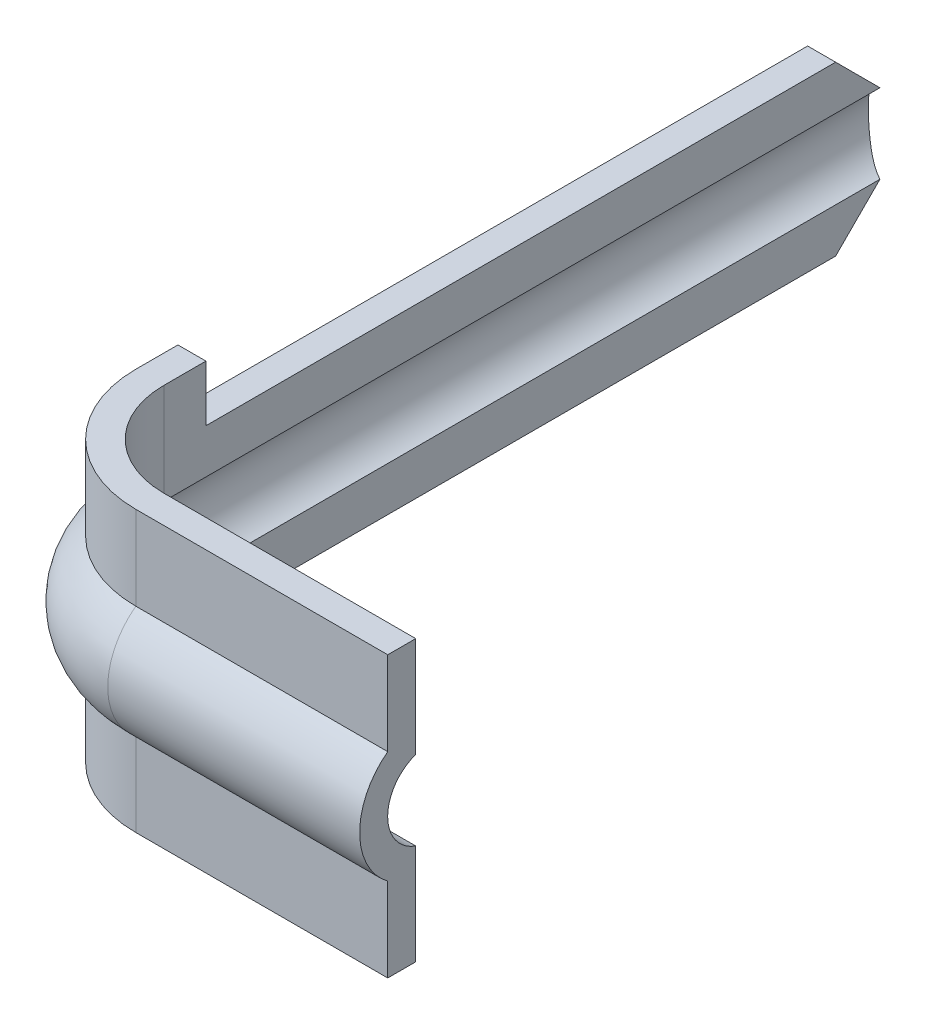
ISO-10303-21;
HEADER;
FILE_DESCRIPTION(('STEP AP214'),'2;1');
FILE_NAME('part.step','',(''),(''),'','','');
FILE_SCHEMA(('AUTOMOTIVE_DESIGN { 1 0 10303 214 1 1 1 1 }'));
ENDSEC;
DATA;
#1=APPLICATION_CONTEXT('core data for automotive mechanical design processes');
#2=APPLICATION_PROTOCOL_DEFINITION('international standard','automotive_design',2000,#1);
#3=PRODUCT_CONTEXT('',#1,'mechanical');
#4=PRODUCT('Part','Part','',(#3));
#5=PRODUCT_RELATED_PRODUCT_CATEGORY('part','',(#4));
#6=PRODUCT_DEFINITION_FORMATION('','',#4);
#7=PRODUCT_DEFINITION_CONTEXT('part definition',#1,'design');
#8=PRODUCT_DEFINITION('design','',#6,#7);
#9=PRODUCT_DEFINITION_SHAPE('','',#8);
#10=(LENGTH_UNIT() NAMED_UNIT(*) SI_UNIT(.MILLI.,.METRE.));
#11=(NAMED_UNIT(*) PLANE_ANGLE_UNIT() SI_UNIT($,.RADIAN.));
#12=(NAMED_UNIT(*) SI_UNIT($,.STERADIAN.) SOLID_ANGLE_UNIT());
#13=UNCERTAINTY_MEASURE_WITH_UNIT(LENGTH_MEASURE(1.E-05),#10,'distance_accuracy_value','');
#14=(GEOMETRIC_REPRESENTATION_CONTEXT(3) GLOBAL_UNCERTAINTY_ASSIGNED_CONTEXT((#13)) GLOBAL_UNIT_ASSIGNED_CONTEXT((#10,
#11,#12)) REPRESENTATION_CONTEXT('',''));
#15=CARTESIAN_POINT('',(0.,0.,0.));
#16=DIRECTION('',(0.,0.,1.));
#17=DIRECTION('',(1.,0.,0.));
#18=AXIS2_PLACEMENT_3D('',#15,#16,#17);
#19=CARTESIAN_POINT('',(0.65,0.,4.47548513561487));
#20=DIRECTION('',(1.,0.,0.));
#21=DIRECTION('',(0.,0.,-1.));
#22=AXIS2_PLACEMENT_3D('',#19,#20,#21);
#23=CYLINDRICAL_SURFACE('',#22,0.375);
#24=DIRECTION('',(1.,0.,0.));
#25=VECTOR('',#24,1.);
#26=CARTESIAN_POINT('',(0.65,0.300363239545214,4.7));
#27=LINE('',#26,#25);
#28=CARTESIAN_POINT('',(0.65,0.300363239545214,4.7));
#29=VERTEX_POINT('',#28);
#30=CARTESIAN_POINT('',(2.,0.300363239545216,4.7));
#31=VERTEX_POINT('',#30);
#32=EDGE_CURVE('E160',#29,#31,#27,.T.);
#33=ORIENTED_EDGE('',*,*,#32,.F.);
#34=CARTESIAN_POINT('',(0.65,0.,4.47548513561487));
#35=DIRECTION('',(1.,0.,0.));
#36=DIRECTION('',(0.,0.,-1.));
#37=AXIS2_PLACEMENT_3D('',#34,#35,#36);
#38=CIRCLE('',#37,0.375);
#39=CARTESIAN_POINT('',(0.65,-0.300363239545311,4.7));
#40=VERTEX_POINT('',#39);
#41=EDGE_CURVE('E164',#29,#40,#38,.T.);
#42=ORIENTED_EDGE('',*,*,#41,.T.);
#43=DIRECTION('',(1.,0.,0.));
#44=VECTOR('',#43,1.);
#45=CARTESIAN_POINT('',(0.65,-0.300363239545311,4.7));
#46=LINE('',#45,#44);
#47=CARTESIAN_POINT('',(2.,-0.300363239545313,4.7));
#48=VERTEX_POINT('',#47);
#49=EDGE_CURVE('E162',#48,#40,#46,.F.);
#50=ORIENTED_EDGE('',*,*,#49,.F.);
#51=CARTESIAN_POINT('',(2.,0.,4.47548513561487));
#52=DIRECTION('',(1.,0.,0.));
#53=DIRECTION('',(0.,0.,-1.));
#54=AXIS2_PLACEMENT_3D('',#51,#52,#53);
#55=CIRCLE('',#54,0.375);
#56=EDGE_CURVE('E19',#48,#31,#55,.F.);
#57=ORIENTED_EDGE('',*,*,#56,.T.);
#58=EDGE_LOOP('',(#33,#42,#50,#57));
#59=FACE_BOUND('',#58,.T.);
#60=ADVANCED_FACE('F16',(#59),#23,.T.);
#61=CARTESIAN_POINT('',(0.65,0.,4.47548513561487));
#62=DIRECTION('',(1.,0.,0.));
#63=DIRECTION('',(0.,0.,-1.));
#64=AXIS2_PLACEMENT_3D('',#61,#62,#63);
#65=CYLINDRICAL_SURFACE('',#64,0.225);
#66=CARTESIAN_POINT('',(2.,0.,4.47548513561487));
#67=DIRECTION('',(1.,0.,0.));
#68=DIRECTION('',(0.,0.,-1.));
#69=AXIS2_PLACEMENT_3D('',#66,#67,#68);
#70=CIRCLE('',#69,0.225);
#71=CARTESIAN_POINT('',(2.,0.212302932117396,4.55));
#72=VERTEX_POINT('',#71);
#73=CARTESIAN_POINT('',(2.,-0.212302933509844,4.54999999603301));
#74=VERTEX_POINT('',#73);
#75=EDGE_CURVE('E178',#72,#74,#70,.T.);
#76=ORIENTED_EDGE('',*,*,#75,.T.);
#77=DIRECTION('',(-1.,0.,0.));
#78=VECTOR('',#77,1.);
#79=CARTESIAN_POINT('',(0.65,-0.212302933509843,4.54999999603301));
#80=LINE('',#79,#78);
#81=CARTESIAN_POINT('',(0.65,-0.212302933509843,4.54999999603301));
#82=VERTEX_POINT('',#81);
#83=EDGE_CURVE('E244',#82,#74,#80,.F.);
#84=ORIENTED_EDGE('',*,*,#83,.F.);
#85=CARTESIAN_POINT('',(0.65,0.,4.47548513561486));
#86=DIRECTION('',(1.,0.,0.));
#87=DIRECTION('',(0.,0.,1.));
#88=AXIS2_PLACEMENT_3D('',#85,#86,#87);
#89=CIRCLE('',#88,0.225);
#90=CARTESIAN_POINT('',(0.65,0.212302932117393,4.55000000000001));
#91=VERTEX_POINT('',#90);
#92=EDGE_CURVE('E269',#82,#91,#89,.F.);
#93=ORIENTED_EDGE('',*,*,#92,.T.);
#94=DIRECTION('',(-1.,0.,0.));
#95=VECTOR('',#94,1.);
#96=CARTESIAN_POINT('',(0.65,0.212302932117392,4.55));
#97=LINE('',#96,#95);
#98=EDGE_CURVE('E217',#72,#91,#97,.T.);
#99=ORIENTED_EDGE('',*,*,#98,.F.);
#100=EDGE_LOOP('',(#76,#84,#93,#99));
#101=FACE_BOUND('',#100,.T.);
#102=ADVANCED_FACE('F289',(#101),#65,.F.);
#103=CARTESIAN_POINT('',(0.65,0.,4.05));
#104=DIRECTION('',(0.,1.,0.));
#105=DIRECTION('',(0.,0.,1.));
#106=AXIS2_PLACEMENT_3D('',#103,#104,#105);
#107=TOROIDAL_SURFACE('',#106,0.425485135614863,0.225);
#108=ORIENTED_EDGE('',*,*,#92,.F.);
#109=CARTESIAN_POINT('',(0.65,-0.212302933509843,4.05));
#110=DIRECTION('',(0.,1.,0.));
#111=DIRECTION('',(0.,0.,1.));
#112=AXIS2_PLACEMENT_3D('',#109,#110,#111);
#113=CIRCLE('',#112,0.49999999603301);
#114=CARTESIAN_POINT('',(0.15000000396699,-0.212302933509843,4.05));
#115=VERTEX_POINT('',#114);
#116=EDGE_CURVE('E245',#82,#115,#113,.F.);
#117=ORIENTED_EDGE('',*,*,#116,.T.);
#118=CARTESIAN_POINT('',(0.224514864385137,0.,4.05));
#119=DIRECTION('',(0.,0.,1.));
#120=DIRECTION('',(1.,0.,0.));
#121=AXIS2_PLACEMENT_3D('',#118,#119,#120);
#122=CIRCLE('',#121,0.225);
#123=CARTESIAN_POINT('',(0.149999999999983,0.212302932117392,4.05));
#124=VERTEX_POINT('',#123);
#125=EDGE_CURVE('E227',#115,#124,#122,.F.);
#126=ORIENTED_EDGE('',*,*,#125,.T.);
#127=CARTESIAN_POINT('',(0.65,0.212302932117392,4.05));
#128=DIRECTION('',(0.,1.,0.));
#129=DIRECTION('',(0.,0.,1.));
#130=AXIS2_PLACEMENT_3D('',#127,#128,#129);
#131=CIRCLE('',#130,0.500000000000017);
#132=EDGE_CURVE('E213',#124,#91,#131,.T.);
#133=ORIENTED_EDGE('',*,*,#132,.T.);
#134=EDGE_LOOP('',(#108,#117,#126,#133));
#135=FACE_BOUND('',#134,.T.);
#136=ADVANCED_FACE('F285',(#135),#107,.F.);
#137=CARTESIAN_POINT('',(0.65,0.,4.05));
#138=DIRECTION('',(0.,1.,0.));
#139=DIRECTION('',(0.,0.,1.));
#140=AXIS2_PLACEMENT_3D('',#137,#138,#139);
#141=CYLINDRICAL_SURFACE('',#140,0.49999999603301);
#142=CARTESIAN_POINT('',(0.65,-0.75,4.05));
#143=DIRECTION('',(0.,1.,0.));
#144=DIRECTION('',(0.,0.,1.));
#145=AXIS2_PLACEMENT_3D('',#142,#143,#144);
#146=CIRCLE('',#145,0.49999999603301);
#147=CARTESIAN_POINT('',(0.150000003852884,-0.75,4.05));
#148=VERTEX_POINT('',#147);
#149=CARTESIAN_POINT('',(0.65,-0.75,4.54999999603301));
#150=VERTEX_POINT('',#149);
#151=EDGE_CURVE('E368',#148,#150,#146,.T.);
#152=ORIENTED_EDGE('',*,*,#151,.F.);
#153=DIRECTION('',(0.,1.,0.));
#154=VECTOR('',#153,1.);
#155=CARTESIAN_POINT('',(0.150000003966989,-0.75,4.05));
#156=LINE('',#155,#154);
#157=EDGE_CURVE('E248',#115,#148,#156,.F.);
#158=ORIENTED_EDGE('',*,*,#157,.F.);
#159=ORIENTED_EDGE('',*,*,#116,.F.);
#160=DIRECTION('',(0.,1.,0.));
#161=VECTOR('',#160,1.);
#162=CARTESIAN_POINT('',(0.65,-0.75,4.54999999603301));
#163=LINE('',#162,#161);
#164=EDGE_CURVE('E241',#150,#82,#163,.T.);
#165=ORIENTED_EDGE('',*,*,#164,.F.);
#166=EDGE_LOOP('',(#152,#158,#159,#165));
#167=FACE_BOUND('',#166,.T.);
#168=ADVANCED_FACE('F288',(#167),#141,.F.);
#169=CARTESIAN_POINT('',(0.65,-0.75,4.54999999603301));
#170=DIRECTION('',(0.,0.,-1.));
#171=DIRECTION('',(-1.,0.,0.));
#172=AXIS2_PLACEMENT_3D('',#169,#170,#171);
#173=PLANE('',#172);
#174=ORIENTED_EDGE('',*,*,#164,.T.);
#175=ORIENTED_EDGE('',*,*,#83,.T.);
#176=DIRECTION('',(0.,1.,0.));
#177=VECTOR('',#176,1.);
#178=CARTESIAN_POINT('',(2.,0.,4.54999999603301));
#179=LINE('',#178,#177);
#180=CARTESIAN_POINT('',(2.,-0.75,4.54999999603301));
#181=VERTEX_POINT('',#180);
#182=EDGE_CURVE('E184',#74,#181,#179,.F.);
#183=ORIENTED_EDGE('',*,*,#182,.T.);
#184=DIRECTION('',(1.,0.,0.));
#185=VECTOR('',#184,1.);
#186=CARTESIAN_POINT('',(0.,-0.75,4.54999999603301));
#187=LINE('',#186,#185);
#188=EDGE_CURVE('E238',#150,#181,#187,.T.);
#189=ORIENTED_EDGE('',*,*,#188,.F.);
#190=EDGE_LOOP('',(#174,#175,#183,#189));
#191=FACE_BOUND('',#190,.T.);
#192=ADVANCED_FACE('F353',(#191),#173,.T.);
#193=CARTESIAN_POINT('',(0.65,-0.300363239545311,4.7));
#194=DIRECTION('',(0.,0.,1.));
#195=DIRECTION('',(1.,0.,0.));
#196=AXIS2_PLACEMENT_3D('',#193,#194,#195);
#197=PLANE('',#196);
#198=ORIENTED_EDGE('',*,*,#49,.T.);
#199=DIRECTION('',(0.,1.,0.));
#200=VECTOR('',#199,1.);
#201=CARTESIAN_POINT('',(0.65,-0.300363239545311,4.7));
#202=LINE('',#201,#200);
#203=CARTESIAN_POINT('',(0.65,-0.75,4.7));
#204=VERTEX_POINT('',#203);
#205=EDGE_CURVE('E229',#40,#204,#202,.F.);
#206=ORIENTED_EDGE('',*,*,#205,.T.);
#207=DIRECTION('',(1.,0.,0.));
#208=VECTOR('',#207,1.);
#209=CARTESIAN_POINT('',(0.,-0.75,4.7));
#210=LINE('',#209,#208);
#211=CARTESIAN_POINT('',(2.,-0.75,4.7));
#212=VERTEX_POINT('',#211);
#213=EDGE_CURVE('E224',#212,#204,#210,.F.);
#214=ORIENTED_EDGE('',*,*,#213,.F.);
#215=DIRECTION('',(0.,1.,0.));
#216=VECTOR('',#215,1.);
#217=CARTESIAN_POINT('',(2.,0.,4.7));
#218=LINE('',#217,#216);
#219=EDGE_CURVE('E179',#212,#48,#218,.T.);
#220=ORIENTED_EDGE('',*,*,#219,.T.);
#221=EDGE_LOOP('',(#198,#206,#214,#220));
#222=FACE_BOUND('',#221,.T.);
#223=ADVANCED_FACE('F349',(#222),#197,.T.);
#224=CARTESIAN_POINT('',(0.224514864385138,0.,0.));
#225=DIRECTION('',(0.,0.,1.));
#226=DIRECTION('',(1.,0.,0.));
#227=AXIS2_PLACEMENT_3D('',#224,#225,#226);
#228=CYLINDRICAL_SURFACE('',#227,0.225);
#229=DIRECTION('',(0.,0.,-1.));
#230=VECTOR('',#229,1.);
#231=CARTESIAN_POINT('',(0.149999999999984,0.212302932117392,0.));
#232=LINE('',#231,#230);
#233=CARTESIAN_POINT('',(0.149757432221938,0.212217483247041,0.212217483226314));
#234=VERTEX_POINT('',#233);
#235=EDGE_CURVE('E220',#124,#234,#232,.T.);
#236=ORIENTED_EDGE('',*,*,#235,.F.);
#237=ORIENTED_EDGE('',*,*,#125,.F.);
#238=DIRECTION('',(0.,0.,-1.));
#239=VECTOR('',#238,1.);
#240=CARTESIAN_POINT('',(0.15000000396699,-0.212302933509843,0.));
#241=LINE('',#240,#239);
#242=CARTESIAN_POINT('',(0.149757434146686,-0.212217483922541,0.212217483943265));
#243=VERTEX_POINT('',#242);
#244=EDGE_CURVE('E251',#243,#115,#241,.F.);
#245=ORIENTED_EDGE('',*,*,#244,.F.);
#246=CARTESIAN_POINT('',(0.149757346702161,0.21221754393944,0.212217665156353));
#247=CARTESIAN_POINT('',(0.136913331339535,0.207665311898192,0.207641285261507));
#248=CARTESIAN_POINT('',(0.124743609192929,0.202093573160082,0.202374706611005));
#249=CARTESIAN_POINT('',(0.101764791812559,0.189038470445277,0.191163639415629));
#250=CARTESIAN_POINT('',(0.0909592756904194,0.18155022785134,0.185217442549227));
#251=CARTESIAN_POINT('',(0.0708231016284059,0.164844008717313,0.173401493911863));
#252=CARTESIAN_POINT('',(0.0614873586093797,0.155632248626892,0.167531546053112));
#253=CARTESIAN_POINT('',(0.0444262683993457,0.135522936559536,0.156374193563733));
#254=CARTESIAN_POINT('',(0.0366983669126014,0.124628107126819,0.151085871333887));
#255=CARTESIAN_POINT('',(0.0245245326978146,0.103655504290283,0.142561158713519));
#256=CARTESIAN_POINT('',(0.0197308197484496,0.0938608249430644,0.139126152403672));
#257=CARTESIAN_POINT('',(0.011551086021331,0.0734316039872059,0.133196081029953));
#258=CARTESIAN_POINT('',(0.00816396133167622,0.0627977288224827,0.130700279009129));
#259=CARTESIAN_POINT('',(0.00296983712234125,0.0408707701312072,0.126851678206735));
#260=CARTESIAN_POINT('',(0.00117302238926358,0.0295739247620855,0.125506248564731));
#261=CARTESIAN_POINT('',(-0.000674152154730775,0.00675883042992519,0.124122956573618));
#262=CARTESIAN_POINT('',(-0.000725196683673462,-0.00475932995634256,0.124084581577523));
#263=CARTESIAN_POINT('',(0.000833666883458502,-0.0264026469089063,0.125252200857111));
#264=CARTESIAN_POINT('',(0.00227132925443989,-0.0365480597377179,0.126329151778766));
#265=CARTESIAN_POINT('',(0.00646367665865537,-0.0564065368881361,0.129443181820884));
#266=CARTESIAN_POINT('',(0.00921845957677584,-0.066119569017708,0.131480332300658));
#267=CARTESIAN_POINT('',(0.0160140530283502,-0.0851947367255245,0.136441161024372));
#268=CARTESIAN_POINT('',(0.0200917183415792,-0.0945369707055503,0.139390115283347));
#269=CARTESIAN_POINT('',(0.0293447755621372,-0.112405646504791,0.145955322285442));
#270=CARTESIAN_POINT('',(0.0345208304332887,-0.120931591099158,0.149571977866256));
#271=CARTESIAN_POINT('',(0.0467655263477221,-0.138428197465193,0.157906567622749));
#272=CARTESIAN_POINT('',(0.0540056176606778,-0.147238922958504,0.16270770193375));
#273=CARTESIAN_POINT('',(0.0696222494078104,-0.163588406049553,0.172608615901019));
#274=CARTESIAN_POINT('',(0.0779992964986616,-0.171126593191963,0.177708528121245));
#275=CARTESIAN_POINT('',(0.0962391997336202,-0.185230153836376,0.18810855100274));
#276=CARTESIAN_POINT('',(0.106154613379122,-0.191730103686799,0.193406286455824));
#277=CARTESIAN_POINT('',(0.127115306318748,-0.203172042032617,0.203400371109372));
#278=CARTESIAN_POINT('',(0.138160612314672,-0.208113993697874,0.208096706091531));
#279=CARTESIAN_POINT('',(0.149757322899515,-0.212217600568487,0.212217635117401));
#280=B_SPLINE_CURVE_WITH_KNOTS('',3,(#246,#247,#248,#249,#250,#251,#252,#253,#254,#255,#256,
#257,#258,#259,#260,#261,#262,#263,#264,#265,#266,#267,#268,#269,#270,#271,#272,#273,#274,#275,
#276,#277,#278,#279),.UNSPECIFIED.,.F.,.F.,(4,2,2,2,2,2,2,2,2,2,2,2,2,2,2,2,4),(0.,
0.0429747666319987,0.0860600364104163,0.128992799998506,0.171856828737294,0.206019561810953,
0.240155432548395,0.274508369205703,0.308847831956318,0.339614768140892,0.370383991197601,
0.402097005387604,0.433829215578944,0.470813229583805,0.5078137790613,0.546619925154412,
0.585426988532671),.UNSPECIFIED.);
#281=EDGE_CURVE('E172',#234,#243,#280,.T.);
#282=ORIENTED_EDGE('',*,*,#281,.F.);
#283=EDGE_LOOP('',(#236,#237,#245,#282));
#284=FACE_BOUND('',#283,.T.);
#285=ADVANCED_FACE('F344',(#284),#228,.F.);
#286=CARTESIAN_POINT('',(0.65,0.75,4.7));
#287=DIRECTION('',(0.,0.,1.));
#288=DIRECTION('',(1.,0.,0.));
#289=AXIS2_PLACEMENT_3D('',#286,#287,#288);
#290=PLANE('',#289);
#291=DIRECTION('',(1.,0.,0.));
#292=VECTOR('',#291,1.);
#293=CARTESIAN_POINT('',(0.149999999999984,0.75,4.7));
#294=LINE('',#293,#292);
#295=CARTESIAN_POINT('',(0.65,0.75,4.7));
#296=VERTEX_POINT('',#295);
#297=CARTESIAN_POINT('',(2.,0.75,4.7));
#298=VERTEX_POINT('',#297);
#299=EDGE_CURVE('E435',#296,#298,#294,.T.);
#300=ORIENTED_EDGE('',*,*,#299,.F.);
#301=DIRECTION('',(0.,1.,0.));
#302=VECTOR('',#301,1.);
#303=CARTESIAN_POINT('',(0.65,0.75,4.7));
#304=LINE('',#303,#302);
#305=EDGE_CURVE('E171',#296,#29,#304,.F.);
#306=ORIENTED_EDGE('',*,*,#305,.T.);
#307=ORIENTED_EDGE('',*,*,#32,.T.);
#308=DIRECTION('',(0.,1.,0.));
#309=VECTOR('',#308,1.);
#310=CARTESIAN_POINT('',(2.,0.,4.7));
#311=LINE('',#310,#309);
#312=EDGE_CURVE('E169',#31,#298,#311,.T.);
#313=ORIENTED_EDGE('',*,*,#312,.T.);
#314=EDGE_LOOP('',(#300,#306,#307,#313));
#315=FACE_BOUND('',#314,.T.);
#316=ADVANCED_FACE('F168',(#315),#290,.T.);
#317=CARTESIAN_POINT('',(2.,0.,4.47548513561487));
#318=DIRECTION('',(-1.,0.,0.));
#319=DIRECTION('',(0.,0.,1.));
#320=AXIS2_PLACEMENT_3D('',#317,#318,#319);
#321=PLANE('',#320);
#322=DIRECTION('',(0.,1.,0.));
#323=VECTOR('',#322,1.);
#324=CARTESIAN_POINT('',(2.,0.212302932117392,4.55));
#325=LINE('',#324,#323);
#326=CARTESIAN_POINT('',(2.,0.75,4.55));
#327=VERTEX_POINT('',#326);
#328=EDGE_CURVE('E182',#327,#72,#325,.F.);
#329=ORIENTED_EDGE('',*,*,#328,.F.);
#330=DIRECTION('',(0.,0.,1.));
#331=VECTOR('',#330,1.);
#332=CARTESIAN_POINT('',(2.,0.75,0.));
#333=LINE('',#332,#331);
#334=EDGE_CURVE('E176',#298,#327,#333,.F.);
#335=ORIENTED_EDGE('',*,*,#334,.F.);
#336=ORIENTED_EDGE('',*,*,#312,.F.);
#337=ORIENTED_EDGE('',*,*,#56,.F.);
#338=ORIENTED_EDGE('',*,*,#219,.F.);
#339=DIRECTION('',(0.,0.,-1.));
#340=VECTOR('',#339,1.);
#341=CARTESIAN_POINT('',(2.,-0.75,0.));
#342=LINE('',#341,#340);
#343=EDGE_CURVE('E235',#181,#212,#342,.F.);
#344=ORIENTED_EDGE('',*,*,#343,.F.);
#345=ORIENTED_EDGE('',*,*,#182,.F.);
#346=ORIENTED_EDGE('',*,*,#75,.F.);
#347=EDGE_LOOP('',(#329,#335,#336,#337,#338,#344,#345,#346));
#348=FACE_BOUND('',#347,.T.);
#349=ADVANCED_FACE('F174',(#348),#321,.F.);
#350=CARTESIAN_POINT('',(0.65,0.212302932117392,4.55));
#351=DIRECTION('',(0.,0.,-1.));
#352=DIRECTION('',(-1.,0.,0.));
#353=AXIS2_PLACEMENT_3D('',#350,#351,#352);
#354=PLANE('',#353);
#355=ORIENTED_EDGE('',*,*,#98,.T.);
#356=DIRECTION('',(0.,1.,0.));
#357=VECTOR('',#356,1.);
#358=CARTESIAN_POINT('',(0.65,0.,4.55000000000002));
#359=LINE('',#358,#357);
#360=CARTESIAN_POINT('',(0.65,0.75,4.55000000000001));
#361=VERTEX_POINT('',#360);
#362=EDGE_CURVE('E216',#91,#361,#359,.T.);
#363=ORIENTED_EDGE('',*,*,#362,.T.);
#364=DIRECTION('',(1.,0.,0.));
#365=VECTOR('',#364,1.);
#366=CARTESIAN_POINT('',(0.149999999999984,0.75,4.55));
#367=LINE('',#366,#365);
#368=EDGE_CURVE('E434',#327,#361,#367,.F.);
#369=ORIENTED_EDGE('',*,*,#368,.F.);
#370=ORIENTED_EDGE('',*,*,#328,.T.);
#371=EDGE_LOOP('',(#355,#363,#369,#370));
#372=FACE_BOUND('',#371,.T.);
#373=ADVANCED_FACE('F577',(#372),#354,.T.);
#374=CARTESIAN_POINT('',(0.65,0.,4.05));
#375=DIRECTION('',(0.,1.,0.));
#376=DIRECTION('',(0.,0.,1.));
#377=AXIS2_PLACEMENT_3D('',#374,#375,#376);
#378=CYLINDRICAL_SURFACE('',#377,0.500000000000017);
#379=ORIENTED_EDGE('',*,*,#362,.F.);
#380=ORIENTED_EDGE('',*,*,#132,.F.);
#381=DIRECTION('',(0.,1.,0.));
#382=VECTOR('',#381,1.);
#383=CARTESIAN_POINT('',(0.149999999999983,0.212302932117392,4.05));
#384=LINE('',#383,#382);
#385=CARTESIAN_POINT('',(0.149999999999983,0.75,4.05));
#386=VERTEX_POINT('',#385);
#387=EDGE_CURVE('E207',#386,#124,#384,.F.);
#388=ORIENTED_EDGE('',*,*,#387,.F.);
#389=CARTESIAN_POINT('',(0.65,0.75,4.05));
#390=DIRECTION('',(0.,1.,0.));
#391=DIRECTION('',(0.,0.,1.));
#392=AXIS2_PLACEMENT_3D('',#389,#390,#391);
#393=CIRCLE('',#392,0.500000000000017);
#394=EDGE_CURVE('E438',#361,#386,#393,.F.);
#395=ORIENTED_EDGE('',*,*,#394,.F.);
#396=EDGE_LOOP('',(#379,#380,#388,#395));
#397=FACE_BOUND('',#396,.T.);
#398=ADVANCED_FACE('F530',(#397),#378,.F.);
#399=CARTESIAN_POINT('',(0.15000000396699,-0.75,0.));
#400=DIRECTION('',(1.,0.,0.));
#401=DIRECTION('',(0.,0.,-1.));
#402=AXIS2_PLACEMENT_3D('',#399,#400,#401);
#403=PLANE('',#402);
#404=DIRECTION('',(0.,0.,-1.));
#405=VECTOR('',#404,1.);
#406=CARTESIAN_POINT('',(0.150000003738779,-0.75,0.));
#407=LINE('',#406,#405);
#408=CARTESIAN_POINT('',(0.150000003840206,-0.75,3.82426435867505));
#409=VERTEX_POINT('',#408);
#410=EDGE_CURVE('E401',#409,#148,#407,.F.);
#411=ORIENTED_EDGE('',*,*,#410,.F.);
#412=DIRECTION('',(0.,1.,0.));
#413=VECTOR('',#412,1.);
#414=CARTESIAN_POINT('',(0.150000003966989,-0.75,3.82426435867505));
#415=LINE('',#414,#413);
#416=CARTESIAN_POINT('',(0.15000000389092,-0.449999999979276,3.82426435867505));
#417=VERTEX_POINT('',#416);
#418=EDGE_CURVE('E250',#409,#417,#415,.T.);
#419=ORIENTED_EDGE('',*,*,#418,.T.);
#420=DIRECTION('',(0.,0.,-1.));
#421=VECTOR('',#420,1.);
#422=CARTESIAN_POINT('',(0.150000003852885,-0.449999999979276,0.));
#423=LINE('',#422,#421);
#424=CARTESIAN_POINT('',(0.15000000389092,-0.449999999979276,0.45));
#425=VERTEX_POINT('',#424);
#426=EDGE_CURVE('E425',#425,#417,#423,.F.);
#427=ORIENTED_EDGE('',*,*,#426,.F.);
#428=DIRECTION('',(0.,0.707106781186547,-0.707106781186548));
#429=VECTOR('',#428,1.);
#430=CARTESIAN_POINT('',(0.15000000396699,-0.449999999979276,0.45));
#431=LINE('',#430,#429);
#432=EDGE_CURVE('E274',#425,#243,#431,.T.);
#433=ORIENTED_EDGE('',*,*,#432,.T.);
#434=ORIENTED_EDGE('',*,*,#244,.T.);
#435=ORIENTED_EDGE('',*,*,#157,.T.);
#436=EDGE_LOOP('',(#411,#419,#427,#433,#434,#435));
#437=FACE_BOUND('',#436,.T.);
#438=ADVANCED_FACE('F572',(#437),#403,.T.);
#439=CARTESIAN_POINT('',(0.,-0.75,0.));
#440=DIRECTION('',(0.,-1.,0.));
#441=DIRECTION('',(0.,0.,-1.));
#442=AXIS2_PLACEMENT_3D('',#439,#440,#441);
#443=PLANE('',#442);
#444=ORIENTED_EDGE('',*,*,#213,.T.);
#445=CARTESIAN_POINT('',(0.65,-0.75,4.05));
#446=DIRECTION('',(0.,1.,0.));
#447=DIRECTION('',(0.,0.,1.));
#448=AXIS2_PLACEMENT_3D('',#445,#446,#447);
#449=CIRCLE('',#448,0.65);
#450=CARTESIAN_POINT('',(0.,-0.75,4.05));
#451=VERTEX_POINT('',#450);
#452=EDGE_CURVE('E257',#451,#204,#449,.T.);
#453=ORIENTED_EDGE('',*,*,#452,.F.);
#454=DIRECTION('',(0.,0.,-1.));
#455=VECTOR('',#454,1.);
#456=CARTESIAN_POINT('',(0.,-0.75,0.));
#457=LINE('',#456,#455);
#458=CARTESIAN_POINT('',(0.,-0.75,3.82426435867505));
#459=VERTEX_POINT('',#458);
#460=EDGE_CURVE('E410',#451,#459,#457,.T.);
#461=ORIENTED_EDGE('',*,*,#460,.T.);
#462=DIRECTION('',(-1.,0.,0.));
#463=VECTOR('',#462,1.);
#464=CARTESIAN_POINT('',(0.150000003738779,-0.75,3.82426435867505));
#465=LINE('',#464,#463);
#466=EDGE_CURVE('E254',#409,#459,#465,.T.);
#467=ORIENTED_EDGE('',*,*,#466,.F.);
#468=ORIENTED_EDGE('',*,*,#410,.T.);
#469=ORIENTED_EDGE('',*,*,#151,.T.);
#470=ORIENTED_EDGE('',*,*,#188,.T.);
#471=ORIENTED_EDGE('',*,*,#343,.T.);
#472=EDGE_LOOP('',(#444,#453,#461,#467,#468,#469,#470,#471));
#473=FACE_BOUND('',#472,.T.);
#474=ADVANCED_FACE('F399',(#473),#443,.T.);
#475=CARTESIAN_POINT('',(0.149999999999984,0.212302932117392,0.));
#476=DIRECTION('',(1.,0.,0.));
#477=DIRECTION('',(0.,0.,-1.));
#478=AXIS2_PLACEMENT_3D('',#475,#476,#477);
#479=PLANE('',#478);
#480=DIRECTION('',(0.,0.,1.));
#481=VECTOR('',#480,1.);
#482=CARTESIAN_POINT('',(0.149999999999983,0.75,0.));
#483=LINE('',#482,#481);
#484=CARTESIAN_POINT('',(0.149999999999983,0.75,3.82426435867505));
#485=VERTEX_POINT('',#484);
#486=EDGE_CURVE('E204',#386,#485,#483,.F.);
#487=ORIENTED_EDGE('',*,*,#486,.F.);
#488=ORIENTED_EDGE('',*,*,#387,.T.);
#489=ORIENTED_EDGE('',*,*,#235,.T.);
#490=DIRECTION('',(0.,0.707106781186546,0.707106781186549));
#491=VECTOR('',#490,1.);
#492=CARTESIAN_POINT('',(0.149999999999984,0.212302932117392,0.212302932096665));
#493=LINE('',#492,#491);
#494=CARTESIAN_POINT('',(0.149999999923994,0.450000000020726,0.45));
#495=VERTEX_POINT('',#494);
#496=EDGE_CURVE('E223',#234,#495,#493,.T.);
#497=ORIENTED_EDGE('',*,*,#496,.T.);
#498=DIRECTION('',(0.,0.,1.));
#499=VECTOR('',#498,1.);
#500=CARTESIAN_POINT('',(0.149999999772015,0.450000000020726,3.82426435867505));
#501=LINE('',#500,#499);
#502=CARTESIAN_POINT('',(0.149999999848004,0.450000000020726,3.82426435867505));
#503=VERTEX_POINT('',#502);
#504=EDGE_CURVE('E460',#503,#495,#501,.F.);
#505=ORIENTED_EDGE('',*,*,#504,.F.);
#506=DIRECTION('',(0.,1.,0.));
#507=VECTOR('',#506,1.);
#508=CARTESIAN_POINT('',(0.149999999999983,0.212302932117392,3.82426435867505));
#509=LINE('',#508,#507);
#510=EDGE_CURVE('E210',#503,#485,#509,.T.);
#511=ORIENTED_EDGE('',*,*,#510,.T.);
#512=EDGE_LOOP('',(#487,#488,#489,#497,#505,#511));
#513=FACE_BOUND('',#512,.T.);
#514=ADVANCED_FACE('F533',(#513),#479,.T.);
#515=CARTESIAN_POINT('',(0.149999999999984,0.75,0.));
#516=DIRECTION('',(0.,1.,0.));
#517=DIRECTION('',(0.,0.,1.));
#518=AXIS2_PLACEMENT_3D('',#515,#516,#517);
#519=PLANE('',#518);
#520=ORIENTED_EDGE('',*,*,#368,.T.);
#521=ORIENTED_EDGE('',*,*,#394,.T.);
#522=ORIENTED_EDGE('',*,*,#486,.T.);
#523=DIRECTION('',(1.,0.,0.));
#524=VECTOR('',#523,1.);
#525=CARTESIAN_POINT('',(0.149999999999984,0.75,3.82426435867505));
#526=LINE('',#525,#524);
#527=CARTESIAN_POINT('',(0.,0.75,3.82426435867505));
#528=VERTEX_POINT('',#527);
#529=EDGE_CURVE('E200',#485,#528,#526,.F.);
#530=ORIENTED_EDGE('',*,*,#529,.T.);
#531=DIRECTION('',(0.,0.,1.));
#532=VECTOR('',#531,1.);
#533=CARTESIAN_POINT('',(0.,0.75,0.));
#534=LINE('',#533,#532);
#535=CARTESIAN_POINT('',(0.,0.75,4.05));
#536=VERTEX_POINT('',#535);
#537=EDGE_CURVE('E203',#528,#536,#534,.T.);
#538=ORIENTED_EDGE('',*,*,#537,.T.);
#539=CARTESIAN_POINT('',(0.65,0.75,4.05));
#540=DIRECTION('',(0.,1.,0.));
#541=DIRECTION('',(0.,0.,1.));
#542=AXIS2_PLACEMENT_3D('',#539,#540,#541);
#543=CIRCLE('',#542,0.65);
#544=EDGE_CURVE('E495',#296,#536,#543,.F.);
#545=ORIENTED_EDGE('',*,*,#544,.F.);
#546=ORIENTED_EDGE('',*,*,#299,.T.);
#547=ORIENTED_EDGE('',*,*,#334,.T.);
#548=EDGE_LOOP('',(#520,#521,#522,#530,#538,#545,#546,#547));
#549=FACE_BOUND('',#548,.T.);
#550=ADVANCED_FACE('F525',(#549),#519,.T.);
#551=CARTESIAN_POINT('',(0.150000003738779,-0.449999999979276,0.));
#552=DIRECTION('',(0.,-1.,0.));
#553=DIRECTION('',(0.,0.,-1.));
#554=AXIS2_PLACEMENT_3D('',#551,#552,#553);
#555=PLANE('',#554);
#556=ORIENTED_EDGE('',*,*,#426,.T.);
#557=DIRECTION('',(-1.,0.,0.));
#558=VECTOR('',#557,1.);
#559=CARTESIAN_POINT('',(0.150000003738779,-0.449999999979276,3.82426435867505));
#560=LINE('',#559,#558);
#561=CARTESIAN_POINT('',(0.,-0.449999999979276,3.82426435867505));
#562=VERTEX_POINT('',#561);
#563=EDGE_CURVE('E258',#562,#417,#560,.F.);
#564=ORIENTED_EDGE('',*,*,#563,.F.);
#565=DIRECTION('',(0.,0.,1.));
#566=VECTOR('',#565,1.);
#567=CARTESIAN_POINT('',(0.,-0.449999999979276,0.));
#568=LINE('',#567,#566);
#569=CARTESIAN_POINT('',(0.,-0.449999999979276,0.45));
#570=VERTEX_POINT('',#569);
#571=EDGE_CURVE('E265',#570,#562,#568,.T.);
#572=ORIENTED_EDGE('',*,*,#571,.F.);
#573=DIRECTION('',(1.,0.,0.));
#574=VECTOR('',#573,1.);
#575=CARTESIAN_POINT('',(0.224514864385138,-0.449999999979276,0.45));
#576=LINE('',#575,#574);
#577=EDGE_CURVE('E474',#570,#425,#576,.T.);
#578=ORIENTED_EDGE('',*,*,#577,.T.);
#579=EDGE_LOOP('',(#556,#564,#572,#578));
#580=FACE_BOUND('',#579,.T.);
#581=ADVANCED_FACE('F568',(#580),#555,.T.);
#582=CARTESIAN_POINT('',(0.150000003738779,-0.449999999979276,3.82426435867505));
#583=DIRECTION('',(0.,0.,-1.));
#584=DIRECTION('',(-1.,0.,0.));
#585=AXIS2_PLACEMENT_3D('',#582,#583,#584);
#586=PLANE('',#585);
#587=ORIENTED_EDGE('',*,*,#418,.F.);
#588=ORIENTED_EDGE('',*,*,#466,.T.);
#589=DIRECTION('',(0.,-1.,0.));
#590=VECTOR('',#589,1.);
#591=CARTESIAN_POINT('',(0.,-0.300363239545311,3.82426435867505));
#592=LINE('',#591,#590);
#593=EDGE_CURVE('E261',#562,#459,#592,.T.);
#594=ORIENTED_EDGE('',*,*,#593,.F.);
#595=ORIENTED_EDGE('',*,*,#563,.T.);
#596=EDGE_LOOP('',(#587,#588,#594,#595));
#597=FACE_BOUND('',#596,.T.);
#598=ADVANCED_FACE('F565',(#597),#586,.T.);
#599=CARTESIAN_POINT('',(0.65,0.,4.05));
#600=DIRECTION('',(0.,1.,0.));
#601=DIRECTION('',(0.,0.,1.));
#602=AXIS2_PLACEMENT_3D('',#599,#600,#601);
#603=CYLINDRICAL_SURFACE('',#602,0.65);
#604=CARTESIAN_POINT('',(0.65,-0.30036323954531,4.05));
#605=DIRECTION('',(0.,1.,0.));
#606=DIRECTION('',(0.,0.,1.));
#607=AXIS2_PLACEMENT_3D('',#604,#605,#606);
#608=CIRCLE('',#607,0.649999999999998);
#609=CARTESIAN_POINT('',(0.,-0.30036323954531,4.05));
#610=VERTEX_POINT('',#609);
#611=EDGE_CURVE('E388',#610,#40,#608,.T.);
#612=ORIENTED_EDGE('',*,*,#611,.F.);
#613=DIRECTION('',(0.,-1.,0.));
#614=VECTOR('',#613,1.);
#615=CARTESIAN_POINT('',(0.,-0.300363239545311,4.05));
#616=LINE('',#615,#614);
#617=EDGE_CURVE('E264',#451,#610,#616,.F.);
#618=ORIENTED_EDGE('',*,*,#617,.F.);
#619=ORIENTED_EDGE('',*,*,#452,.T.);
#620=ORIENTED_EDGE('',*,*,#205,.F.);
#621=EDGE_LOOP('',(#612,#618,#619,#620));
#622=FACE_BOUND('',#621,.T.);
#623=ADVANCED_FACE('F386',(#622),#603,.T.);
#624=CARTESIAN_POINT('',(0.149999999772015,0.450000000020726,3.82426435867505));
#625=DIRECTION('',(0.,1.,0.));
#626=DIRECTION('',(0.,0.,1.));
#627=AXIS2_PLACEMENT_3D('',#624,#625,#626);
#628=PLANE('',#627);
#629=DIRECTION('',(0.,0.,1.));
#630=VECTOR('',#629,1.);
#631=CARTESIAN_POINT('',(0.,0.450000000020726,0.));
#632=LINE('',#631,#630);
#633=CARTESIAN_POINT('',(0.,0.450000000020726,3.82426435867505));
#634=VERTEX_POINT('',#633);
#635=CARTESIAN_POINT('',(0.,0.450000000020726,0.45));
#636=VERTEX_POINT('',#635);
#637=EDGE_CURVE('E487',#634,#636,#632,.F.);
#638=ORIENTED_EDGE('',*,*,#637,.F.);
#639=DIRECTION('',(-1.,0.,0.));
#640=VECTOR('',#639,1.);
#641=CARTESIAN_POINT('',(0.149999999772015,0.450000000020726,3.82426435867505));
#642=LINE('',#641,#640);
#643=EDGE_CURVE('E484',#503,#634,#642,.T.);
#644=ORIENTED_EDGE('',*,*,#643,.F.);
#645=ORIENTED_EDGE('',*,*,#504,.T.);
#646=DIRECTION('',(1.,0.,0.));
#647=VECTOR('',#646,1.);
#648=CARTESIAN_POINT('',(0.149999999772015,0.450000000020726,0.45));
#649=LINE('',#648,#647);
#650=EDGE_CURVE('E480',#495,#636,#649,.F.);
#651=ORIENTED_EDGE('',*,*,#650,.T.);
#652=EDGE_LOOP('',(#638,#644,#645,#651));
#653=FACE_BOUND('',#652,.T.);
#654=ADVANCED_FACE('F600',(#653),#628,.T.);
#655=CARTESIAN_POINT('',(0.65,0.,4.05));
#656=DIRECTION('',(0.,1.,0.));
#657=DIRECTION('',(0.,0.,1.));
#658=AXIS2_PLACEMENT_3D('',#655,#656,#657);
#659=CYLINDRICAL_SURFACE('',#658,0.65);
#660=ORIENTED_EDGE('',*,*,#544,.T.);
#661=DIRECTION('',(0.,-1.,0.));
#662=VECTOR('',#661,1.);
#663=CARTESIAN_POINT('',(0.,0.75,4.05));
#664=LINE('',#663,#662);
#665=CARTESIAN_POINT('',(0.,0.300363239545213,4.05));
#666=VERTEX_POINT('',#665);
#667=EDGE_CURVE('E34',#666,#536,#664,.F.);
#668=ORIENTED_EDGE('',*,*,#667,.F.);
#669=CARTESIAN_POINT('',(0.65,0.300363239545213,4.05));
#670=DIRECTION('',(0.,1.,0.));
#671=DIRECTION('',(0.,0.,1.));
#672=AXIS2_PLACEMENT_3D('',#669,#670,#671);
#673=CIRCLE('',#672,0.65);
#674=EDGE_CURVE('E395',#29,#666,#673,.F.);
#675=ORIENTED_EDGE('',*,*,#674,.F.);
#676=ORIENTED_EDGE('',*,*,#305,.F.);
#677=EDGE_LOOP('',(#660,#668,#675,#676));
#678=FACE_BOUND('',#677,.T.);
#679=ADVANCED_FACE('F603',(#678),#659,.T.);
#680=CARTESIAN_POINT('',(0.149999999772015,1.07437198248293,3.82426435867505));
#681=DIRECTION('',(0.,0.,-1.));
#682=DIRECTION('',(-1.,0.,0.));
#683=AXIS2_PLACEMENT_3D('',#680,#681,#682);
#684=PLANE('',#683);
#685=DIRECTION('',(0.,-1.,0.));
#686=VECTOR('',#685,1.);
#687=CARTESIAN_POINT('',(0.,0.75,3.82426435867505));
#688=LINE('',#687,#686);
#689=EDGE_CURVE('E498',#528,#634,#688,.T.);
#690=ORIENTED_EDGE('',*,*,#689,.F.);
#691=ORIENTED_EDGE('',*,*,#529,.F.);
#692=ORIENTED_EDGE('',*,*,#510,.F.);
#693=ORIENTED_EDGE('',*,*,#643,.T.);
#694=EDGE_LOOP('',(#690,#691,#692,#693));
#695=FACE_BOUND('',#694,.T.);
#696=ADVANCED_FACE('F537',(#695),#684,.T.);
#697=CARTESIAN_POINT('',(0.149999999772015,0.450000000020726,0.45));
#698=DIRECTION('',(0.,-0.707106781186547,0.707106781186548));
#699=DIRECTION('',(0.,-0.707106781186548,-0.707106781186547));
#700=AXIS2_PLACEMENT_3D('',#697,#698,#699);
#701=PLANE('',#700);
#702=CARTESIAN_POINT('',(0.224514864385138,0.,-2.07735958619222E-11));
#703=DIRECTION('',(0.,-0.707106781186547,0.707106781186548));
#704=DIRECTION('',(0.,0.707106781186548,0.707106781186547));
#705=AXIS2_PLACEMENT_3D('',#702,#703,#704);
#706=ELLIPSE('',#705,0.53033008588991,0.375);
#707=CARTESIAN_POINT('',(0.,0.300363239545213,0.300363239524487));
#708=VERTEX_POINT('',#707);
#709=CARTESIAN_POINT('',(-0.084718057521936,0.212132034376689,0.212132034355963));
#710=VERTEX_POINT('',#709);
#711=EDGE_CURVE('E323',#708,#710,#706,.T.);
#712=ORIENTED_EDGE('',*,*,#711,.F.);
#713=DIRECTION('',(0.,-0.707106781186547,-0.707106781186548));
#714=VECTOR('',#713,1.);
#715=CARTESIAN_POINT('',(0.,0.450000000020726,0.45));
#716=LINE('',#715,#714);
#717=EDGE_CURVE('E490',#636,#708,#716,.T.);
#718=ORIENTED_EDGE('',*,*,#717,.F.);
#719=ORIENTED_EDGE('',*,*,#650,.F.);
#720=ORIENTED_EDGE('',*,*,#496,.F.);
#721=DIRECTION('',(-1.,0.,0.));
#722=VECTOR('',#721,1.);
#723=CARTESIAN_POINT('',(0.149999999772015,0.21213203437669,0.212132034355963));
#724=LINE('',#723,#722);
#725=EDGE_CURVE('E477',#710,#234,#724,.F.);
#726=ORIENTED_EDGE('',*,*,#725,.F.);
#727=EDGE_LOOP('',(#712,#718,#719,#720,#726));
#728=FACE_BOUND('',#727,.T.);
#729=ADVANCED_FACE('F332',(#728),#701,.F.);
#730=CARTESIAN_POINT('',(0.149999999772015,2.07248226826579E-11,0.424264068711927));
#731=DIRECTION('',(-1.,0.,0.));
#732=DIRECTION('',(0.,0.,1.));
#733=AXIS2_PLACEMENT_3D('',#730,#731,#732);
#734=CYLINDRICAL_SURFACE('',#733,0.3);
#735=CARTESIAN_POINT('',(-0.0847180575219361,0.212132034376689,0.212132034355963));
#736=CARTESIAN_POINT('',(-0.0922319983032283,0.201199190962822,0.201199627164466));
#737=CARTESIAN_POINT('',(-0.0995268876092536,0.189299838787945,0.190992372318736));
#738=CARTESIAN_POINT('',(-0.113222164139016,0.163614918001356,0.172302633287896));
#739=CARTESIAN_POINT('',(-0.119615836500899,0.149816563703569,0.163832902331881));
#740=CARTESIAN_POINT('',(-0.130041274966982,0.122841979749024,0.150219662585385));
#741=CARTESIAN_POINT('',(-0.134286365930285,0.109909279982118,0.144762512788199));
#742=CARTESIAN_POINT('',(-0.141422908840085,0.0831020691178226,0.135657692865165));
#743=CARTESIAN_POINT('',(-0.144318316734224,0.0692304486466451,0.132004732726046));
#744=CARTESIAN_POINT('',(-0.1485406180254,0.0407750816779417,0.126693947271234));
#745=CARTESIAN_POINT('',(-0.14985724547405,0.0261873095792529,0.125049178885964));
#746=CARTESIAN_POINT('',(-0.150758619145556,-0.00313336820448735,0.123922025700408));
#747=CARTESIAN_POINT('',(-0.150342778446313,-0.0178663213870842,0.124440373716474));
#748=CARTESIAN_POINT('',(-0.147941569167471,-0.0455646775461277,0.127448547623856));
#749=CARTESIAN_POINT('',(-0.14610874243397,-0.0585652302862654,0.129746802140002));
#750=CARTESIAN_POINT('',(-0.141201140990535,-0.0839267888556918,0.13594686094851));
#751=CARTESIAN_POINT('',(-0.138126353457212,-0.0962877880800294,0.139848681797889));
#752=CARTESIAN_POINT('',(-0.130737799122018,-0.120804067829709,0.149330155850892));
#753=CARTESIAN_POINT('',(-0.126364585018955,-0.132909582919145,0.154991125193698));
#754=CARTESIAN_POINT('',(-0.116728320752583,-0.155995693666358,0.167672256016149));
#755=CARTESIAN_POINT('',(-0.111464706265096,-0.166975568775779,0.174693279892794));
#756=CARTESIAN_POINT('',(-0.0992025116357579,-0.189823844725305,0.191444374387241));
#757=CARTESIAN_POINT('',(-0.0920675211872435,-0.201430394460462,0.201435403081374));
#758=CARTESIAN_POINT('',(-0.0847180575505615,-0.212132034336477,0.212132034354367));
#759=B_SPLINE_CURVE_WITH_KNOTS('',3,(#735,#736,#737,#738,#739,#740,#741,#742,#743,#744,#745,
#746,#747,#748,#749,#750,#751,#752,#753,#754,#755,#756,#757,#758),.UNSPECIFIED.,.F.,.F.,(4,2,2,
2,2,2,2,2,2,2,2,4),(0.,0.0516206501524656,0.103607608400576,0.147417389781696,0.19109794366922,
0.2350610143264,0.279038979915739,0.318847476165853,0.358656383453834,0.400681565814417,
0.442733483671007,0.493200119775364),.UNSPECIFIED.);
#760=CARTESIAN_POINT('',(-0.0847180575504369,-0.21213203433524,0.212132034355964));
#761=VERTEX_POINT('',#760);
#762=EDGE_CURVE('E313',#710,#761,#759,.T.);
#763=ORIENTED_EDGE('',*,*,#762,.F.);
#764=ORIENTED_EDGE('',*,*,#725,.T.);
#765=ORIENTED_EDGE('',*,*,#281,.T.);
#766=DIRECTION('',(1.,0.,0.));
#767=VECTOR('',#766,1.);
#768=CARTESIAN_POINT('',(0.224514864385138,-0.21213203433524,0.212132034355964));
#769=LINE('',#768,#767);
#770=EDGE_CURVE('E471',#243,#761,#769,.F.);
#771=ORIENTED_EDGE('',*,*,#770,.T.);
#772=EDGE_LOOP('',(#763,#764,#765,#771));
#773=FACE_BOUND('',#772,.T.);
#774=ADVANCED_FACE('F326',(#773),#734,.T.);
#775=CARTESIAN_POINT('',(0.224514864385138,2.0723874005757E-11,0.));
#776=DIRECTION('',(0.,0.707106781186548,0.707106781186548));
#777=DIRECTION('',(0.,-0.707106781186548,0.707106781186548));
#778=AXIS2_PLACEMENT_3D('',#775,#776,#777);
#779=PLANE('',#778);
#780=ORIENTED_EDGE('',*,*,#770,.F.);
#781=ORIENTED_EDGE('',*,*,#432,.F.);
#782=ORIENTED_EDGE('',*,*,#577,.F.);
#783=DIRECTION('',(0.,-0.707106781186547,0.707106781186548));
#784=VECTOR('',#783,1.);
#785=CARTESIAN_POINT('',(0.,-0.300363239545311,0.300363239566035));
#786=LINE('',#785,#784);
#787=CARTESIAN_POINT('',(0.,-0.30036323954531,0.300363239566034));
#788=VERTEX_POINT('',#787);
#789=EDGE_CURVE('E473',#788,#570,#786,.T.);
#790=ORIENTED_EDGE('',*,*,#789,.F.);
#791=CARTESIAN_POINT('',(0.224514864385138,0.,2.07722294226499E-11));
#792=DIRECTION('',(0.,0.707106781186548,0.707106781186548));
#793=DIRECTION('',(0.,-0.707106781186548,0.707106781186548));
#794=AXIS2_PLACEMENT_3D('',#791,#792,#793);
#795=ELLIPSE('',#794,0.530330085889911,0.375);
#796=EDGE_CURVE('E322',#761,#788,#795,.T.);
#797=ORIENTED_EDGE('',*,*,#796,.F.);
#798=EDGE_LOOP('',(#780,#781,#782,#790,#797));
#799=FACE_BOUND('',#798,.T.);
#800=ADVANCED_FACE('F331',(#799),#779,.F.);
#801=CARTESIAN_POINT('',(0.,-0.300363239545311,0.));
#802=DIRECTION('',(-1.,0.,0.));
#803=DIRECTION('',(0.,-1.,0.));
#804=AXIS2_PLACEMENT_3D('',#801,#802,#803);
#805=PLANE('',#804);
#806=ORIENTED_EDGE('',*,*,#460,.F.);
#807=ORIENTED_EDGE('',*,*,#617,.T.);
#808=DIRECTION('',(0.,0.,1.));
#809=VECTOR('',#808,1.);
#810=CARTESIAN_POINT('',(0.,-0.30036323954531,0.));
#811=LINE('',#810,#809);
#812=EDGE_CURVE('E548',#788,#610,#811,.T.);
#813=ORIENTED_EDGE('',*,*,#812,.F.);
#814=ORIENTED_EDGE('',*,*,#789,.T.);
#815=ORIENTED_EDGE('',*,*,#571,.T.);
#816=ORIENTED_EDGE('',*,*,#593,.T.);
#817=EDGE_LOOP('',(#806,#807,#813,#814,#815,#816));
#818=FACE_BOUND('',#817,.T.);
#819=ADVANCED_FACE('F555',(#818),#805,.T.);
#820=CARTESIAN_POINT('',(0.65,0.,4.05));
#821=DIRECTION('',(0.,1.,0.));
#822=DIRECTION('',(0.,0.,1.));
#823=AXIS2_PLACEMENT_3D('',#820,#821,#822);
#824=TOROIDAL_SURFACE('',#823,0.425485135614863,0.375);
#825=ORIENTED_EDGE('',*,*,#674,.T.);
#826=CARTESIAN_POINT('',(0.224514864385137,0.,4.05));
#827=DIRECTION('',(0.,0.,1.));
#828=DIRECTION('',(1.,0.,0.));
#829=AXIS2_PLACEMENT_3D('',#826,#827,#828);
#830=CIRCLE('',#829,0.375);
#831=EDGE_CURVE('E25',#610,#666,#830,.F.);
#832=ORIENTED_EDGE('',*,*,#831,.F.);
#833=ORIENTED_EDGE('',*,*,#611,.T.);
#834=ORIENTED_EDGE('',*,*,#41,.F.);
#835=EDGE_LOOP('',(#825,#832,#833,#834));
#836=FACE_BOUND('',#835,.T.);
#837=ADVANCED_FACE('F306',(#836),#824,.T.);
#838=CARTESIAN_POINT('',(0.,0.75,0.));
#839=DIRECTION('',(-1.,0.,0.));
#840=DIRECTION('',(0.,-1.,0.));
#841=AXIS2_PLACEMENT_3D('',#838,#839,#840);
#842=PLANE('',#841);
#843=ORIENTED_EDGE('',*,*,#537,.F.);
#844=ORIENTED_EDGE('',*,*,#689,.T.);
#845=ORIENTED_EDGE('',*,*,#637,.T.);
#846=ORIENTED_EDGE('',*,*,#717,.T.);
#847=DIRECTION('',(0.,0.,1.));
#848=VECTOR('',#847,1.);
#849=CARTESIAN_POINT('',(0.,0.300363239545213,0.));
#850=LINE('',#849,#848);
#851=EDGE_CURVE('E11',#666,#708,#850,.F.);
#852=ORIENTED_EDGE('',*,*,#851,.F.);
#853=ORIENTED_EDGE('',*,*,#667,.T.);
#854=EDGE_LOOP('',(#843,#844,#845,#846,#852,#853));
#855=FACE_BOUND('',#854,.T.);
#856=ADVANCED_FACE('F300',(#855),#842,.T.);
#857=CARTESIAN_POINT('',(0.224514864385138,0.,0.));
#858=DIRECTION('',(0.,0.,1.));
#859=DIRECTION('',(1.,0.,0.));
#860=AXIS2_PLACEMENT_3D('',#857,#858,#859);
#861=CYLINDRICAL_SURFACE('',#860,0.375);
#862=ORIENTED_EDGE('',*,*,#831,.T.);
#863=ORIENTED_EDGE('',*,*,#851,.T.);
#864=ORIENTED_EDGE('',*,*,#711,.T.);
#865=ORIENTED_EDGE('',*,*,#762,.T.);
#866=ORIENTED_EDGE('',*,*,#796,.T.);
#867=ORIENTED_EDGE('',*,*,#812,.T.);
#868=EDGE_LOOP('',(#862,#863,#864,#865,#866,#867));
#869=FACE_BOUND('',#868,.T.);
#870=ADVANCED_FACE('F298',(#869),#861,.T.);
#871=CLOSED_SHELL('',(#60,#102,#136,#168,#192,#223,#285,#316,#349,#373,#398,#438,#474,#514,#550,
#581,#598,#623,#654,#679,#696,#729,#774,#800,#819,#837,#856,#870));
#872=MANIFOLD_SOLID_BREP('B1',#871);
#873=ADVANCED_BREP_SHAPE_REPRESENTATION('',(#18,#872),#14);
#874=SHAPE_DEFINITION_REPRESENTATION(#9,#873);
ENDSEC;
END-ISO-10303-21;
